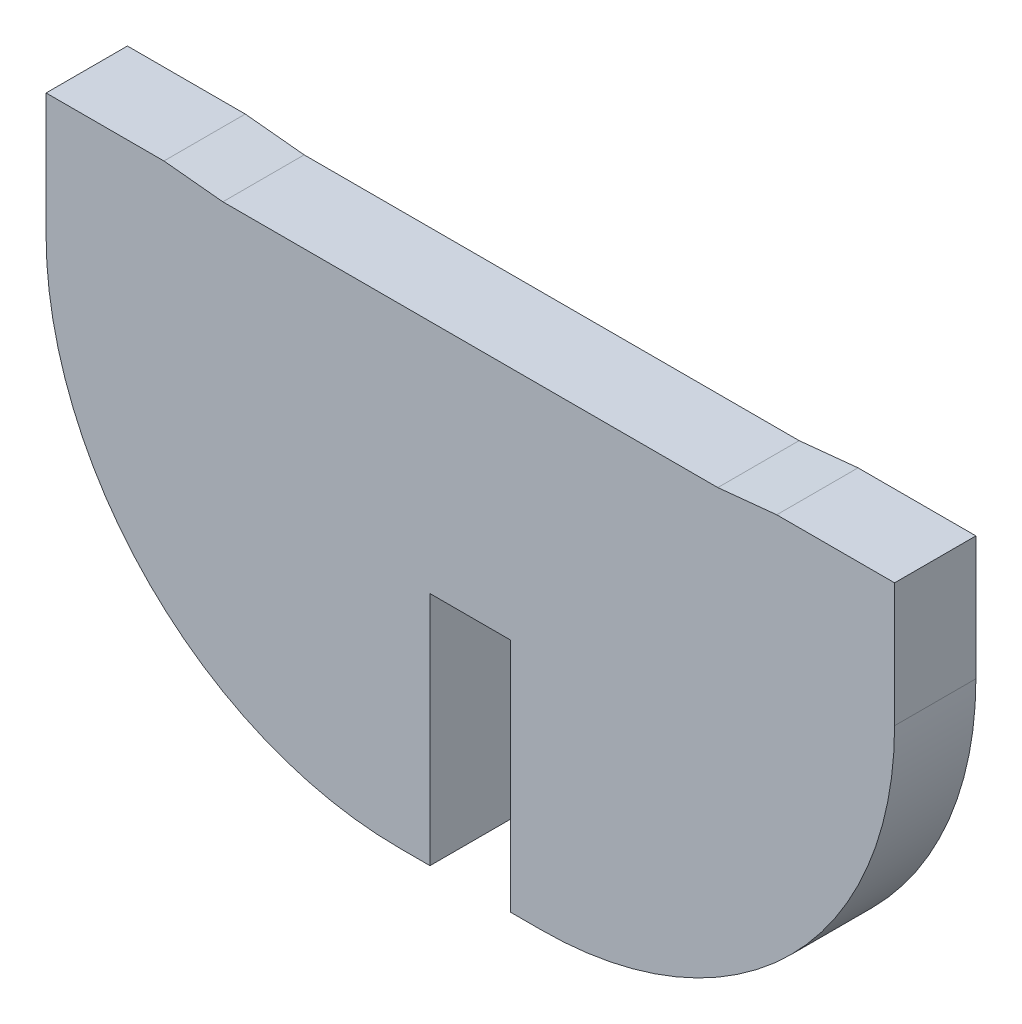
ISO-10303-21;
HEADER;
FILE_DESCRIPTION(('STEP AP214'),'2;1');
FILE_NAME('part.step','',(''),(''),'','','');
FILE_SCHEMA(('AUTOMOTIVE_DESIGN { 1 0 10303 214 1 1 1 1 }'));
ENDSEC;
DATA;
#1=APPLICATION_CONTEXT('core data for automotive mechanical design processes');
#2=APPLICATION_PROTOCOL_DEFINITION('international standard','automotive_design',2000,#1);
#3=PRODUCT_CONTEXT('',#1,'mechanical');
#4=PRODUCT('Part','Part','',(#3));
#5=PRODUCT_RELATED_PRODUCT_CATEGORY('part','',(#4));
#6=PRODUCT_DEFINITION_FORMATION('','',#4);
#7=PRODUCT_DEFINITION_CONTEXT('part definition',#1,'design');
#8=PRODUCT_DEFINITION('design','',#6,#7);
#9=PRODUCT_DEFINITION_SHAPE('','',#8);
#10=(LENGTH_UNIT() NAMED_UNIT(*) SI_UNIT(.MILLI.,.METRE.));
#11=(NAMED_UNIT(*) PLANE_ANGLE_UNIT() SI_UNIT($,.RADIAN.));
#12=(NAMED_UNIT(*) SI_UNIT($,.STERADIAN.) SOLID_ANGLE_UNIT());
#13=UNCERTAINTY_MEASURE_WITH_UNIT(LENGTH_MEASURE(1.E-05),#10,'distance_accuracy_value','');
#14=(GEOMETRIC_REPRESENTATION_CONTEXT(3) GLOBAL_UNCERTAINTY_ASSIGNED_CONTEXT((#13)) GLOBAL_UNIT_ASSIGNED_CONTEXT((#10,
#11,#12)) REPRESENTATION_CONTEXT('',''));
#15=CARTESIAN_POINT('',(0.,0.,0.));
#16=DIRECTION('',(0.,0.,1.));
#17=DIRECTION('',(1.,0.,0.));
#18=AXIS2_PLACEMENT_3D('',#15,#16,#17);
#19=CARTESIAN_POINT('',(36.,20.,6.9));
#20=DIRECTION('',(0.,-1.,0.));
#21=DIRECTION('',(1.,0.,0.));
#22=AXIS2_PLACEMENT_3D('',#19,#20,#21);
#23=PLANE('',#22);
#24=DIRECTION('',(0.,0.,1.));
#25=VECTOR('',#24,1.);
#26=CARTESIAN_POINT('',(21.,20.,-16.9961605992047));
#27=LINE('',#26,#25);
#28=CARTESIAN_POINT('',(21.,20.,0.));
#29=VERTEX_POINT('',#28);
#30=CARTESIAN_POINT('',(21.000000000001,20.0000000000001,6.9));
#31=VERTEX_POINT('',#30);
#32=EDGE_CURVE('E212',#29,#31,#27,.T.);
#33=ORIENTED_EDGE('',*,*,#32,.F.);
#34=DIRECTION('',(-1.,0.,0.));
#35=VECTOR('',#34,1.);
#36=CARTESIAN_POINT('',(36.,20.,0.));
#37=LINE('',#36,#35);
#38=CARTESIAN_POINT('',(-21.,20.,0.));
#39=VERTEX_POINT('',#38);
#40=EDGE_CURVE('E185',#29,#39,#37,.T.);
#41=ORIENTED_EDGE('',*,*,#40,.T.);
#42=DIRECTION('',(0.,0.,1.));
#43=VECTOR('',#42,1.);
#44=CARTESIAN_POINT('',(-21.,20.,-16.9961605992047));
#45=LINE('',#44,#43);
#46=CARTESIAN_POINT('',(-21.,20.,6.9));
#47=VERTEX_POINT('',#46);
#48=EDGE_CURVE('E221',#39,#47,#45,.T.);
#49=ORIENTED_EDGE('',*,*,#48,.T.);
#50=DIRECTION('',(-1.,0.,0.));
#51=VECTOR('',#50,1.);
#52=CARTESIAN_POINT('',(36.,20.,6.9));
#53=LINE('',#52,#51);
#54=EDGE_CURVE('E60',#31,#47,#53,.T.);
#55=ORIENTED_EDGE('',*,*,#54,.F.);
#56=EDGE_LOOP('',(#33,#41,#49,#55));
#57=FACE_BOUND('',#56,.T.);
#58=ADVANCED_FACE('F42',(#57),#23,.F.);
#59=CARTESIAN_POINT('',(36.,-20.,6.9));
#60=DIRECTION('',(0.,1.,0.));
#61=DIRECTION('',(-1.,0.,0.));
#62=AXIS2_PLACEMENT_3D('',#59,#60,#61);
#63=PLANE('',#62);
#64=DIRECTION('',(1.,0.,0.));
#65=VECTOR('',#64,1.);
#66=CARTESIAN_POINT('',(36.,-20.,0.));
#67=LINE('',#66,#65);
#68=CARTESIAN_POINT('',(3.425,-20.,0.));
#69=VERTEX_POINT('',#68);
#70=CARTESIAN_POINT('',(6.00000000000001,-20.,0.));
#71=VERTEX_POINT('',#70);
#72=EDGE_CURVE('E291',#69,#71,#67,.T.);
#73=ORIENTED_EDGE('',*,*,#72,.T.);
#74=DIRECTION('',(0.,0.,-1.));
#75=VECTOR('',#74,1.);
#76=CARTESIAN_POINT('',(6.00000000000001,-20.,6.9));
#77=LINE('',#76,#75);
#78=CARTESIAN_POINT('',(6.00000000000001,-20.,6.9));
#79=VERTEX_POINT('',#78);
#80=EDGE_CURVE('E306',#71,#79,#77,.F.);
#81=ORIENTED_EDGE('',*,*,#80,.T.);
#82=DIRECTION('',(1.,0.,0.));
#83=VECTOR('',#82,1.);
#84=CARTESIAN_POINT('',(36.,-20.,6.9));
#85=LINE('',#84,#83);
#86=CARTESIAN_POINT('',(3.425,-20.,6.9));
#87=VERTEX_POINT('',#86);
#88=EDGE_CURVE('E278',#87,#79,#85,.T.);
#89=ORIENTED_EDGE('',*,*,#88,.F.);
#90=DIRECTION('',(0.,0.,-1.));
#91=VECTOR('',#90,1.);
#92=CARTESIAN_POINT('',(3.425,-20.,6.9));
#93=LINE('',#92,#91);
#94=EDGE_CURVE('E270',#87,#69,#93,.T.);
#95=ORIENTED_EDGE('',*,*,#94,.T.);
#96=EDGE_LOOP('',(#73,#81,#89,#95));
#97=FACE_BOUND('',#96,.T.);
#98=ADVANCED_FACE('F343',(#97),#63,.F.);
#99=CARTESIAN_POINT('',(-36.,20.,6.9));
#100=DIRECTION('',(1.,0.,0.));
#101=DIRECTION('',(0.,0.,-1.));
#102=AXIS2_PLACEMENT_3D('',#99,#100,#101);
#103=PLANE('',#102);
#104=DIRECTION('',(0.,-1.,0.));
#105=VECTOR('',#104,1.);
#106=CARTESIAN_POINT('',(-36.,20.,0.));
#107=LINE('',#106,#105);
#108=CARTESIAN_POINT('',(-36.,20.5,0.));
#109=VERTEX_POINT('',#108);
#110=CARTESIAN_POINT('',(-36.,9.99999999999999,0.));
#111=VERTEX_POINT('',#110);
#112=EDGE_CURVE('E274',#109,#111,#107,.T.);
#113=ORIENTED_EDGE('',*,*,#112,.T.);
#114=DIRECTION('',(0.,0.,-1.));
#115=VECTOR('',#114,1.);
#116=CARTESIAN_POINT('',(-36.,9.99999999999999,6.9));
#117=LINE('',#116,#115);
#118=CARTESIAN_POINT('',(-36.,9.99999999999999,6.9));
#119=VERTEX_POINT('',#118);
#120=EDGE_CURVE('E11',#111,#119,#117,.F.);
#121=ORIENTED_EDGE('',*,*,#120,.T.);
#122=DIRECTION('',(0.,-1.,0.));
#123=VECTOR('',#122,1.);
#124=CARTESIAN_POINT('',(-36.,20.,6.9));
#125=LINE('',#124,#123);
#126=CARTESIAN_POINT('',(-36.,20.5,6.9));
#127=VERTEX_POINT('',#126);
#128=EDGE_CURVE('E275',#127,#119,#125,.T.);
#129=ORIENTED_EDGE('',*,*,#128,.F.);
#130=DIRECTION('',(0.,0.,1.));
#131=VECTOR('',#130,1.);
#132=CARTESIAN_POINT('',(-36.,20.5,-16.9961605992047));
#133=LINE('',#132,#131);
#134=EDGE_CURVE('E227',#109,#127,#133,.T.);
#135=ORIENTED_EDGE('',*,*,#134,.F.);
#136=EDGE_LOOP('',(#113,#121,#129,#135));
#137=FACE_BOUND('',#136,.T.);
#138=ADVANCED_FACE('F348',(#137),#103,.F.);
#139=CARTESIAN_POINT('',(-5.99999999999999,-20.,6.9));
#140=VERTEX_POINT('',#139);
#141=CARTESIAN_POINT('',(-3.425,-20.,6.9));
#142=VERTEX_POINT('',#141);
#143=EDGE_CURVE('E279',#140,#142,#85,.T.);
#144=ORIENTED_EDGE('',*,*,#143,.F.);
#145=DIRECTION('',(0.,0.,-1.));
#146=VECTOR('',#145,1.);
#147=CARTESIAN_POINT('',(-5.99999999999999,-20.,6.9));
#148=LINE('',#147,#146);
#149=CARTESIAN_POINT('',(-5.99999999999999,-20.,0.));
#150=VERTEX_POINT('',#149);
#151=EDGE_CURVE('E51',#140,#150,#148,.T.);
#152=ORIENTED_EDGE('',*,*,#151,.T.);
#153=CARTESIAN_POINT('',(-3.425,-20.,0.));
#154=VERTEX_POINT('',#153);
#155=EDGE_CURVE('E186',#150,#154,#67,.T.);
#156=ORIENTED_EDGE('',*,*,#155,.T.);
#157=DIRECTION('',(0.,0.,1.));
#158=VECTOR('',#157,1.);
#159=CARTESIAN_POINT('',(-3.42499999999999,-20.,6.9));
#160=LINE('',#159,#158);
#161=EDGE_CURVE('E263',#154,#142,#160,.T.);
#162=ORIENTED_EDGE('',*,*,#161,.T.);
#163=EDGE_LOOP('',(#144,#152,#156,#162));
#164=FACE_BOUND('',#163,.T.);
#165=ADVANCED_FACE('F318',(#164),#63,.F.);
#166=CARTESIAN_POINT('',(36.,20.,6.9));
#167=DIRECTION('',(-1.,0.,0.));
#168=DIRECTION('',(0.,-1.,0.));
#169=AXIS2_PLACEMENT_3D('',#166,#167,#168);
#170=PLANE('',#169);
#171=DIRECTION('',(0.,1.,0.));
#172=VECTOR('',#171,1.);
#173=CARTESIAN_POINT('',(36.,20.,6.9));
#174=LINE('',#173,#172);
#175=CARTESIAN_POINT('',(36.,10.,6.9));
#176=VERTEX_POINT('',#175);
#177=CARTESIAN_POINT('',(36.,20.5,6.9));
#178=VERTEX_POINT('',#177);
#179=EDGE_CURVE('E282',#176,#178,#174,.T.);
#180=ORIENTED_EDGE('',*,*,#179,.F.);
#181=DIRECTION('',(0.,0.,-1.));
#182=VECTOR('',#181,1.);
#183=CARTESIAN_POINT('',(36.,10.,6.9));
#184=LINE('',#183,#182);
#185=CARTESIAN_POINT('',(36.,10.,0.));
#186=VERTEX_POINT('',#185);
#187=EDGE_CURVE('E181',#176,#186,#184,.T.);
#188=ORIENTED_EDGE('',*,*,#187,.T.);
#189=DIRECTION('',(0.,1.,0.));
#190=VECTOR('',#189,1.);
#191=CARTESIAN_POINT('',(36.,20.,0.));
#192=LINE('',#191,#190);
#193=CARTESIAN_POINT('',(36.,20.5,0.));
#194=VERTEX_POINT('',#193);
#195=EDGE_CURVE('E174',#186,#194,#192,.T.);
#196=ORIENTED_EDGE('',*,*,#195,.T.);
#197=DIRECTION('',(0.,0.,1.));
#198=VECTOR('',#197,1.);
#199=CARTESIAN_POINT('',(36.,20.5,-16.9961605992047));
#200=LINE('',#199,#198);
#201=EDGE_CURVE('E178',#194,#178,#200,.T.);
#202=ORIENTED_EDGE('',*,*,#201,.T.);
#203=EDGE_LOOP('',(#180,#188,#196,#202));
#204=FACE_BOUND('',#203,.T.);
#205=ADVANCED_FACE('F177',(#204),#170,.F.);
#206=CARTESIAN_POINT('',(0.,0.,6.9));
#207=DIRECTION('',(0.,0.,-1.));
#208=DIRECTION('',(-1.,0.,0.));
#209=AXIS2_PLACEMENT_3D('',#206,#207,#208);
#210=PLANE('',#209);
#211=ORIENTED_EDGE('',*,*,#179,.T.);
#212=DIRECTION('',(1.,0.,0.));
#213=VECTOR('',#212,1.);
#214=CARTESIAN_POINT('',(36.,20.5,6.9));
#215=LINE('',#214,#213);
#216=CARTESIAN_POINT('',(26.,20.5,6.9));
#217=VERTEX_POINT('',#216);
#218=EDGE_CURVE('E193',#217,#178,#215,.T.);
#219=ORIENTED_EDGE('',*,*,#218,.F.);
#220=DIRECTION('',(0.995037190209989,0.0995037190209977,0.));
#221=VECTOR('',#220,1.);
#222=CARTESIAN_POINT('',(26.,20.5,6.9));
#223=LINE('',#222,#221);
#224=EDGE_CURVE('E215',#31,#217,#223,.T.);
#225=ORIENTED_EDGE('',*,*,#224,.F.);
#226=ORIENTED_EDGE('',*,*,#54,.T.);
#227=DIRECTION('',(-0.995037190209989,0.0995037190209977,0.));
#228=VECTOR('',#227,1.);
#229=CARTESIAN_POINT('',(-26.,20.5,6.9));
#230=LINE('',#229,#228);
#231=CARTESIAN_POINT('',(-26.,20.5,6.9));
#232=VERTEX_POINT('',#231);
#233=EDGE_CURVE('E201',#47,#232,#230,.T.);
#234=ORIENTED_EDGE('',*,*,#233,.T.);
#235=DIRECTION('',(-1.,0.,0.));
#236=VECTOR('',#235,1.);
#237=CARTESIAN_POINT('',(-36.,20.5,6.9));
#238=LINE('',#237,#236);
#239=EDGE_CURVE('E206',#232,#127,#238,.T.);
#240=ORIENTED_EDGE('',*,*,#239,.T.);
#241=ORIENTED_EDGE('',*,*,#128,.T.);
#242=CARTESIAN_POINT('',(-5.99999999999999,9.99999999999999,6.9));
#243=DIRECTION('',(0.,0.,-1.));
#244=DIRECTION('',(-1.,0.,0.));
#245=AXIS2_PLACEMENT_3D('',#242,#243,#244);
#246=CIRCLE('',#245,30.);
#247=EDGE_CURVE('E71',#119,#140,#246,.F.);
#248=ORIENTED_EDGE('',*,*,#247,.T.);
#249=ORIENTED_EDGE('',*,*,#143,.T.);
#250=DIRECTION('',(0.,-1.,0.));
#251=VECTOR('',#250,1.);
#252=CARTESIAN_POINT('',(-3.425,-40.,6.9));
#253=LINE('',#252,#251);
#254=CARTESIAN_POINT('',(-3.425,0.,6.9));
#255=VERTEX_POINT('',#254);
#256=EDGE_CURVE('E246',#255,#142,#253,.T.);
#257=ORIENTED_EDGE('',*,*,#256,.F.);
#258=DIRECTION('',(-1.,0.,0.));
#259=VECTOR('',#258,1.);
#260=CARTESIAN_POINT('',(-3.425,0.,6.9));
#261=LINE('',#260,#259);
#262=CARTESIAN_POINT('',(3.425,0.,6.9));
#263=VERTEX_POINT('',#262);
#264=EDGE_CURVE('E253',#263,#255,#261,.T.);
#265=ORIENTED_EDGE('',*,*,#264,.F.);
#266=DIRECTION('',(0.,1.,0.));
#267=VECTOR('',#266,1.);
#268=CARTESIAN_POINT('',(3.425,-40.,6.9));
#269=LINE('',#268,#267);
#270=EDGE_CURVE('E236',#87,#263,#269,.T.);
#271=ORIENTED_EDGE('',*,*,#270,.F.);
#272=ORIENTED_EDGE('',*,*,#88,.T.);
#273=CARTESIAN_POINT('',(6.00000000000001,10.,6.9));
#274=DIRECTION('',(0.,0.,-1.));
#275=DIRECTION('',(-1.,0.,0.));
#276=AXIS2_PLACEMENT_3D('',#273,#274,#275);
#277=CIRCLE('',#276,30.);
#278=EDGE_CURVE('E311',#79,#176,#277,.F.);
#279=ORIENTED_EDGE('',*,*,#278,.T.);
#280=EDGE_LOOP('',(#211,#219,#225,#226,#234,#240,#241,#248,#249,#257,#265,#271,#272,#279));
#281=FACE_BOUND('',#280,.T.);
#282=ADVANCED_FACE('F331',(#281),#210,.F.);
#283=CARTESIAN_POINT('',(0.,0.,0.));
#284=DIRECTION('',(0.,0.,-1.));
#285=DIRECTION('',(-1.,0.,0.));
#286=AXIS2_PLACEMENT_3D('',#283,#284,#285);
#287=PLANE('',#286);
#288=ORIENTED_EDGE('',*,*,#40,.F.);
#289=DIRECTION('',(0.995037190209989,0.0995037190209977,0.));
#290=VECTOR('',#289,1.);
#291=CARTESIAN_POINT('',(26.,20.5,0.));
#292=LINE('',#291,#290);
#293=CARTESIAN_POINT('',(26.,20.5,0.));
#294=VERTEX_POINT('',#293);
#295=EDGE_CURVE('E195',#29,#294,#292,.T.);
#296=ORIENTED_EDGE('',*,*,#295,.T.);
#297=DIRECTION('',(1.,0.,0.));
#298=VECTOR('',#297,1.);
#299=CARTESIAN_POINT('',(36.,20.5,0.));
#300=LINE('',#299,#298);
#301=EDGE_CURVE('E190',#294,#194,#300,.T.);
#302=ORIENTED_EDGE('',*,*,#301,.T.);
#303=ORIENTED_EDGE('',*,*,#195,.F.);
#304=CARTESIAN_POINT('',(6.00000000000001,10.,0.));
#305=DIRECTION('',(0.,0.,-1.));
#306=DIRECTION('',(-1.,0.,0.));
#307=AXIS2_PLACEMENT_3D('',#304,#305,#306);
#308=CIRCLE('',#307,30.);
#309=EDGE_CURVE('E303',#186,#71,#308,.T.);
#310=ORIENTED_EDGE('',*,*,#309,.T.);
#311=ORIENTED_EDGE('',*,*,#72,.F.);
#312=DIRECTION('',(0.,-1.,0.));
#313=VECTOR('',#312,1.);
#314=CARTESIAN_POINT('',(3.425,0.,0.));
#315=LINE('',#314,#313);
#316=CARTESIAN_POINT('',(3.425,0.,0.));
#317=VERTEX_POINT('',#316);
#318=EDGE_CURVE('E287',#317,#69,#315,.T.);
#319=ORIENTED_EDGE('',*,*,#318,.F.);
#320=DIRECTION('',(-1.,0.,0.));
#321=VECTOR('',#320,1.);
#322=CARTESIAN_POINT('',(-3.425,0.,0.));
#323=LINE('',#322,#321);
#324=CARTESIAN_POINT('',(-3.425,0.,0.));
#325=VERTEX_POINT('',#324);
#326=EDGE_CURVE('E241',#317,#325,#323,.T.);
#327=ORIENTED_EDGE('',*,*,#326,.T.);
#328=DIRECTION('',(0.,-1.,0.));
#329=VECTOR('',#328,1.);
#330=CARTESIAN_POINT('',(-3.425,-40.,0.));
#331=LINE('',#330,#329);
#332=EDGE_CURVE('E245',#325,#154,#331,.T.);
#333=ORIENTED_EDGE('',*,*,#332,.T.);
#334=ORIENTED_EDGE('',*,*,#155,.F.);
#335=CARTESIAN_POINT('',(-5.99999999999999,9.99999999999999,0.));
#336=DIRECTION('',(0.,0.,-1.));
#337=DIRECTION('',(-1.,0.,0.));
#338=AXIS2_PLACEMENT_3D('',#335,#336,#337);
#339=CIRCLE('',#338,30.);
#340=EDGE_CURVE('E300',#150,#111,#339,.T.);
#341=ORIENTED_EDGE('',*,*,#340,.T.);
#342=ORIENTED_EDGE('',*,*,#112,.F.);
#343=DIRECTION('',(-1.,0.,0.));
#344=VECTOR('',#343,1.);
#345=CARTESIAN_POINT('',(-36.,20.5,0.));
#346=LINE('',#345,#344);
#347=CARTESIAN_POINT('',(-26.,20.5,0.));
#348=VERTEX_POINT('',#347);
#349=EDGE_CURVE('E223',#348,#109,#346,.T.);
#350=ORIENTED_EDGE('',*,*,#349,.F.);
#351=DIRECTION('',(-0.995037190209989,0.0995037190209977,0.));
#352=VECTOR('',#351,1.);
#353=CARTESIAN_POINT('',(-26.,20.5,0.));
#354=LINE('',#353,#352);
#355=EDGE_CURVE('E229',#39,#348,#354,.T.);
#356=ORIENTED_EDGE('',*,*,#355,.F.);
#357=EDGE_LOOP('',(#288,#296,#302,#303,#310,#311,#319,#327,#333,#334,#341,#342,#350,#356));
#358=FACE_BOUND('',#357,.T.);
#359=ADVANCED_FACE('F198',(#358),#287,.T.);
#360=CARTESIAN_POINT('',(3.425,-40.,0.));
#361=DIRECTION('',(1.,0.,0.));
#362=DIRECTION('',(0.,0.,-1.));
#363=AXIS2_PLACEMENT_3D('',#360,#361,#362);
#364=PLANE('',#363);
#365=ORIENTED_EDGE('',*,*,#270,.T.);
#366=DIRECTION('',(0.,0.,1.));
#367=VECTOR('',#366,1.);
#368=CARTESIAN_POINT('',(3.425,0.,0.));
#369=LINE('',#368,#367);
#370=EDGE_CURVE('E250',#317,#263,#369,.T.);
#371=ORIENTED_EDGE('',*,*,#370,.F.);
#372=ORIENTED_EDGE('',*,*,#318,.T.);
#373=ORIENTED_EDGE('',*,*,#94,.F.);
#374=EDGE_LOOP('',(#365,#371,#372,#373));
#375=FACE_BOUND('',#374,.T.);
#376=ADVANCED_FACE('F338',(#375),#364,.F.);
#377=CARTESIAN_POINT('',(-3.425,-40.,0.));
#378=DIRECTION('',(-1.,0.,0.));
#379=DIRECTION('',(0.,0.,1.));
#380=AXIS2_PLACEMENT_3D('',#377,#378,#379);
#381=PLANE('',#380);
#382=ORIENTED_EDGE('',*,*,#332,.F.);
#383=DIRECTION('',(0.,0.,1.));
#384=VECTOR('',#383,1.);
#385=CARTESIAN_POINT('',(-3.425,0.,0.));
#386=LINE('',#385,#384);
#387=EDGE_CURVE('E260',#325,#255,#386,.T.);
#388=ORIENTED_EDGE('',*,*,#387,.T.);
#389=ORIENTED_EDGE('',*,*,#256,.T.);
#390=ORIENTED_EDGE('',*,*,#161,.F.);
#391=EDGE_LOOP('',(#382,#388,#389,#390));
#392=FACE_BOUND('',#391,.T.);
#393=ADVANCED_FACE('F325',(#392),#381,.F.);
#394=CARTESIAN_POINT('',(-3.425,0.,0.));
#395=DIRECTION('',(0.,1.,0.));
#396=DIRECTION('',(0.,0.,1.));
#397=AXIS2_PLACEMENT_3D('',#394,#395,#396);
#398=PLANE('',#397);
#399=ORIENTED_EDGE('',*,*,#264,.T.);
#400=ORIENTED_EDGE('',*,*,#387,.F.);
#401=ORIENTED_EDGE('',*,*,#326,.F.);
#402=ORIENTED_EDGE('',*,*,#370,.T.);
#403=EDGE_LOOP('',(#399,#400,#401,#402));
#404=FACE_BOUND('',#403,.T.);
#405=ADVANCED_FACE('F327',(#404),#398,.F.);
#406=CARTESIAN_POINT('',(6.00000000000001,10.,6.9));
#407=DIRECTION('',(0.,0.,-1.));
#408=DIRECTION('',(-1.,0.,0.));
#409=AXIS2_PLACEMENT_3D('',#406,#407,#408);
#410=CYLINDRICAL_SURFACE('',#409,30.);
#411=ORIENTED_EDGE('',*,*,#278,.F.);
#412=ORIENTED_EDGE('',*,*,#80,.F.);
#413=ORIENTED_EDGE('',*,*,#309,.F.);
#414=ORIENTED_EDGE('',*,*,#187,.F.);
#415=EDGE_LOOP('',(#411,#412,#413,#414));
#416=FACE_BOUND('',#415,.T.);
#417=ADVANCED_FACE('F355',(#416),#410,.T.);
#418=CARTESIAN_POINT('',(-5.99999999999999,9.99999999999999,6.9));
#419=DIRECTION('',(0.,0.,-1.));
#420=DIRECTION('',(-1.,0.,0.));
#421=AXIS2_PLACEMENT_3D('',#418,#419,#420);
#422=CYLINDRICAL_SURFACE('',#421,30.);
#423=ORIENTED_EDGE('',*,*,#247,.F.);
#424=ORIENTED_EDGE('',*,*,#120,.F.);
#425=ORIENTED_EDGE('',*,*,#340,.F.);
#426=ORIENTED_EDGE('',*,*,#151,.F.);
#427=EDGE_LOOP('',(#423,#424,#425,#426));
#428=FACE_BOUND('',#427,.T.);
#429=ADVANCED_FACE('F44',(#428),#422,.T.);
#430=CARTESIAN_POINT('',(-26.,20.5,-16.9961605992047));
#431=DIRECTION('',(0.0995037190209977,0.995037190209989,0.));
#432=DIRECTION('',(-0.995037190209989,0.0995037190209977,0.));
#433=AXIS2_PLACEMENT_3D('',#430,#431,#432);
#434=PLANE('',#433);
#435=ORIENTED_EDGE('',*,*,#48,.F.);
#436=ORIENTED_EDGE('',*,*,#355,.T.);
#437=DIRECTION('',(0.,0.,1.));
#438=VECTOR('',#437,1.);
#439=CARTESIAN_POINT('',(-26.,20.5,-16.9961605992047));
#440=LINE('',#439,#438);
#441=EDGE_CURVE('E228',#348,#232,#440,.T.);
#442=ORIENTED_EDGE('',*,*,#441,.T.);
#443=ORIENTED_EDGE('',*,*,#233,.F.);
#444=EDGE_LOOP('',(#435,#436,#442,#443));
#445=FACE_BOUND('',#444,.T.);
#446=ADVANCED_FACE('F362',(#445),#434,.T.);
#447=CARTESIAN_POINT('',(-36.,20.5,-16.9961605992047));
#448=DIRECTION('',(0.,1.,0.));
#449=DIRECTION('',(0.,0.,1.));
#450=AXIS2_PLACEMENT_3D('',#447,#448,#449);
#451=PLANE('',#450);
#452=ORIENTED_EDGE('',*,*,#441,.F.);
#453=ORIENTED_EDGE('',*,*,#349,.T.);
#454=ORIENTED_EDGE('',*,*,#134,.T.);
#455=ORIENTED_EDGE('',*,*,#239,.F.);
#456=EDGE_LOOP('',(#452,#453,#454,#455));
#457=FACE_BOUND('',#456,.T.);
#458=ADVANCED_FACE('F381',(#457),#451,.T.);
#459=CARTESIAN_POINT('',(26.,20.5,-16.9961605992047));
#460=DIRECTION('',(0.0995037190209977,-0.995037190209989,0.));
#461=DIRECTION('',(0.995037190209989,0.0995037190209977,0.));
#462=AXIS2_PLACEMENT_3D('',#459,#460,#461);
#463=PLANE('',#462);
#464=ORIENTED_EDGE('',*,*,#295,.F.);
#465=ORIENTED_EDGE('',*,*,#32,.T.);
#466=ORIENTED_EDGE('',*,*,#224,.T.);
#467=DIRECTION('',(0.,0.,1.));
#468=VECTOR('',#467,1.);
#469=CARTESIAN_POINT('',(26.,20.5,-16.9961605992047));
#470=LINE('',#469,#468);
#471=EDGE_CURVE('E216',#294,#217,#470,.T.);
#472=ORIENTED_EDGE('',*,*,#471,.F.);
#473=EDGE_LOOP('',(#464,#465,#466,#472));
#474=FACE_BOUND('',#473,.T.);
#475=ADVANCED_FACE('F385',(#474),#463,.F.);
#476=CARTESIAN_POINT('',(36.,20.5,-16.9961605992047));
#477=DIRECTION('',(0.,-1.,0.));
#478=DIRECTION('',(0.,0.,-1.));
#479=AXIS2_PLACEMENT_3D('',#476,#477,#478);
#480=PLANE('',#479);
#481=ORIENTED_EDGE('',*,*,#301,.F.);
#482=ORIENTED_EDGE('',*,*,#471,.T.);
#483=ORIENTED_EDGE('',*,*,#218,.T.);
#484=ORIENTED_EDGE('',*,*,#201,.F.);
#485=EDGE_LOOP('',(#481,#482,#483,#484));
#486=FACE_BOUND('',#485,.T.);
#487=ADVANCED_FACE('F189',(#486),#480,.F.);
#488=CLOSED_SHELL('',(#58,#98,#138,#165,#205,#282,#359,#376,#393,#405,#417,#429,#446,#458,#475,#487));
#489=MANIFOLD_SOLID_BREP('B2',#488);
#490=ADVANCED_BREP_SHAPE_REPRESENTATION('',(#18,#489),#14);
#491=SHAPE_DEFINITION_REPRESENTATION(#9,#490);
ENDSEC;
END-ISO-10303-21;
